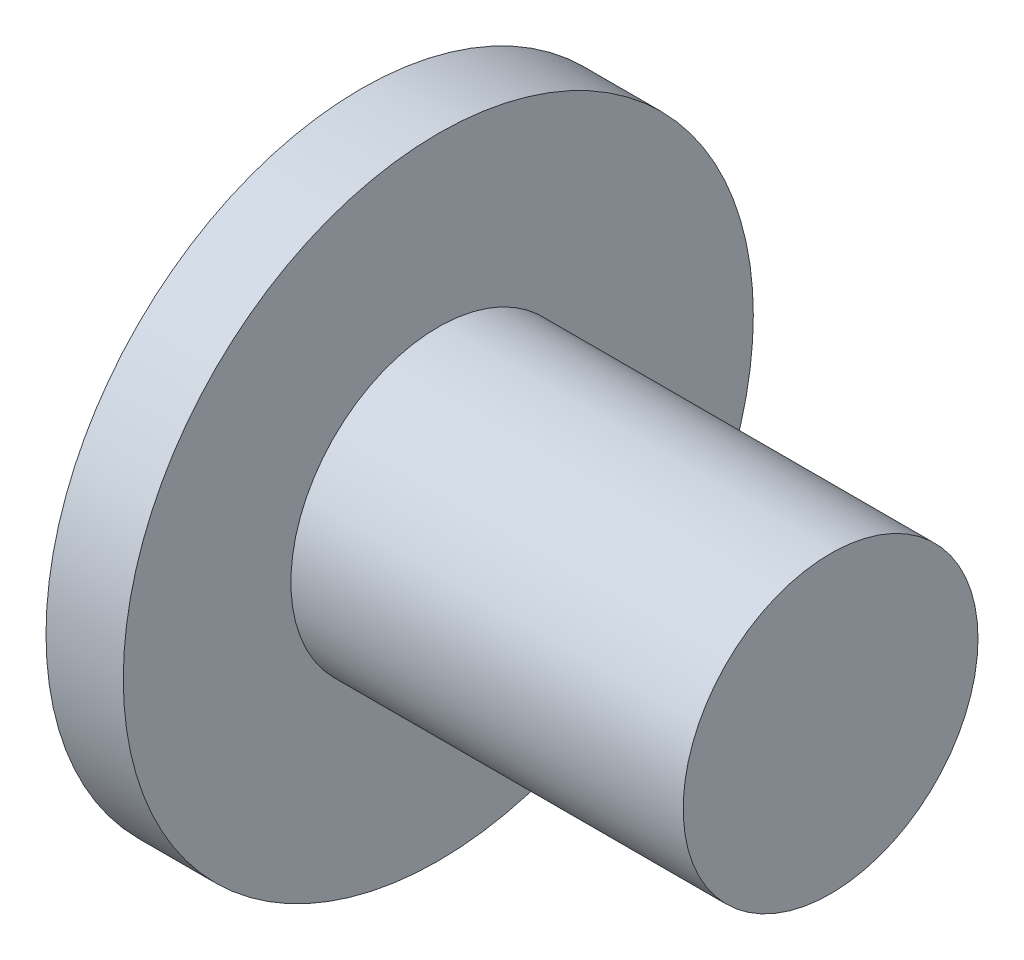
ISO-10303-21;
HEADER;
FILE_DESCRIPTION(('STEP AP214'),'2;1');
FILE_NAME('part.step','',(''),(''),'','','');
FILE_SCHEMA(('AUTOMOTIVE_DESIGN { 1 0 10303 214 1 1 1 1 }'));
ENDSEC;
DATA;
#1=APPLICATION_CONTEXT('core data for automotive mechanical design processes');
#2=APPLICATION_PROTOCOL_DEFINITION('international standard','automotive_design',2000,#1);
#3=PRODUCT_CONTEXT('',#1,'mechanical');
#4=PRODUCT('Part','Part','',(#3));
#5=PRODUCT_RELATED_PRODUCT_CATEGORY('part','',(#4));
#6=PRODUCT_DEFINITION_FORMATION('','',#4);
#7=PRODUCT_DEFINITION_CONTEXT('part definition',#1,'design');
#8=PRODUCT_DEFINITION('design','',#6,#7);
#9=PRODUCT_DEFINITION_SHAPE('','',#8);
#10=(LENGTH_UNIT() NAMED_UNIT(*) SI_UNIT(.MILLI.,.METRE.));
#11=(NAMED_UNIT(*) PLANE_ANGLE_UNIT() SI_UNIT($,.RADIAN.));
#12=(NAMED_UNIT(*) SI_UNIT($,.STERADIAN.) SOLID_ANGLE_UNIT());
#13=UNCERTAINTY_MEASURE_WITH_UNIT(LENGTH_MEASURE(1.E-05),#10,'distance_accuracy_value','');
#14=(GEOMETRIC_REPRESENTATION_CONTEXT(3) GLOBAL_UNCERTAINTY_ASSIGNED_CONTEXT((#13)) GLOBAL_UNIT_ASSIGNED_CONTEXT((#10,
#11,#12)) REPRESENTATION_CONTEXT('',''));
#15=CARTESIAN_POINT('',(0.,0.,0.));
#16=DIRECTION('',(0.,0.,1.));
#17=DIRECTION('',(1.,0.,0.));
#18=AXIS2_PLACEMENT_3D('',#15,#16,#17);
#19=CARTESIAN_POINT('',(1.651,0.,0.));
#20=DIRECTION('',(-1.,0.,0.));
#21=DIRECTION('',(0.,0.,1.));
#22=AXIS2_PLACEMENT_3D('',#19,#20,#21);
#23=CYLINDRICAL_SURFACE('',#22,6.731);
#24=CARTESIAN_POINT('',(1.651,0.,0.));
#25=DIRECTION('',(1.,0.,0.));
#26=DIRECTION('',(0.,0.,-1.));
#27=AXIS2_PLACEMENT_3D('',#24,#25,#26);
#28=CIRCLE('',#27,6.731);
#29=CARTESIAN_POINT('',(1.651,0.,-6.731));
#30=VERTEX_POINT('',#29);
#31=EDGE_CURVE('E10',#30,#30,#28,.T.);
#32=ORIENTED_EDGE('',*,*,#31,.F.);
#33=EDGE_LOOP('',(#32));
#34=FACE_BOUND('',#33,.T.);
#35=CARTESIAN_POINT('',(0.,0.,0.));
#36=DIRECTION('',(1.,0.,0.));
#37=DIRECTION('',(0.,0.,-1.));
#38=AXIS2_PLACEMENT_3D('',#35,#36,#37);
#39=CIRCLE('',#38,6.731);
#40=CARTESIAN_POINT('',(0.,0.,-6.731));
#41=VERTEX_POINT('',#40);
#42=EDGE_CURVE('E35',#41,#41,#39,.T.);
#43=ORIENTED_EDGE('',*,*,#42,.T.);
#44=EDGE_LOOP('',(#43));
#45=FACE_BOUND('',#44,.T.);
#46=ADVANCED_FACE('F32',(#34,#45),#23,.T.);
#47=CARTESIAN_POINT('',(1.651,0.,0.));
#48=DIRECTION('',(1.,0.,0.));
#49=DIRECTION('',(0.,0.,-1.));
#50=AXIS2_PLACEMENT_3D('',#47,#48,#49);
#51=PLANE('',#50);
#52=CARTESIAN_POINT('',(1.651,0.,0.));
#53=DIRECTION('',(1.,0.,0.));
#54=DIRECTION('',(0.,0.,-1.));
#55=AXIS2_PLACEMENT_3D('',#52,#53,#54);
#56=CIRCLE('',#55,3.1496);
#57=CARTESIAN_POINT('',(1.651,0.,-3.1496));
#58=VERTEX_POINT('',#57);
#59=EDGE_CURVE('E44',#58,#58,#56,.T.);
#60=ORIENTED_EDGE('',*,*,#59,.F.);
#61=EDGE_LOOP('',(#60));
#62=FACE_BOUND('',#61,.T.);
#63=ORIENTED_EDGE('',*,*,#31,.T.);
#64=EDGE_LOOP('',(#63));
#65=FACE_BOUND('',#64,.T.);
#66=ADVANCED_FACE('F59',(#62,#65),#51,.T.);
#67=CARTESIAN_POINT('',(0.,0.,0.));
#68=DIRECTION('',(1.,0.,0.));
#69=DIRECTION('',(0.,0.,-1.));
#70=AXIS2_PLACEMENT_3D('',#67,#68,#69);
#71=PLANE('',#70);
#72=ORIENTED_EDGE('',*,*,#42,.F.);
#73=EDGE_LOOP('',(#72));
#74=FACE_BOUND('',#73,.T.);
#75=ADVANCED_FACE('F55',(#74),#71,.F.);
#76=CARTESIAN_POINT('',(10.033,0.,0.));
#77=DIRECTION('',(-1.,0.,0.));
#78=DIRECTION('',(0.,0.,1.));
#79=AXIS2_PLACEMENT_3D('',#76,#77,#78);
#80=CYLINDRICAL_SURFACE('',#79,3.1496);
#81=CARTESIAN_POINT('',(10.033,0.,0.));
#82=DIRECTION('',(1.,0.,0.));
#83=DIRECTION('',(0.,0.,-1.));
#84=AXIS2_PLACEMENT_3D('',#81,#82,#83);
#85=CIRCLE('',#84,3.1496);
#86=CARTESIAN_POINT('',(10.033,0.,-3.1496));
#87=VERTEX_POINT('',#86);
#88=EDGE_CURVE('E42',#87,#87,#85,.T.);
#89=ORIENTED_EDGE('',*,*,#88,.F.);
#90=EDGE_LOOP('',(#89));
#91=FACE_BOUND('',#90,.T.);
#92=ORIENTED_EDGE('',*,*,#59,.T.);
#93=EDGE_LOOP('',(#92));
#94=FACE_BOUND('',#93,.T.);
#95=ADVANCED_FACE('F52',(#91,#94),#80,.T.);
#96=CARTESIAN_POINT('',(10.033,0.,0.));
#97=DIRECTION('',(1.,0.,0.));
#98=DIRECTION('',(0.,0.,-1.));
#99=AXIS2_PLACEMENT_3D('',#96,#97,#98);
#100=PLANE('',#99);
#101=ORIENTED_EDGE('',*,*,#88,.T.);
#102=EDGE_LOOP('',(#101));
#103=FACE_BOUND('',#102,.T.);
#104=ADVANCED_FACE('F50',(#103),#100,.T.);
#105=CLOSED_SHELL('',(#46,#66,#75,#95,#104));
#106=MANIFOLD_SOLID_BREP('B2',#105);
#107=ADVANCED_BREP_SHAPE_REPRESENTATION('',(#18,#106),#14);
#108=SHAPE_DEFINITION_REPRESENTATION(#9,#107);
ENDSEC;
END-ISO-10303-21;
